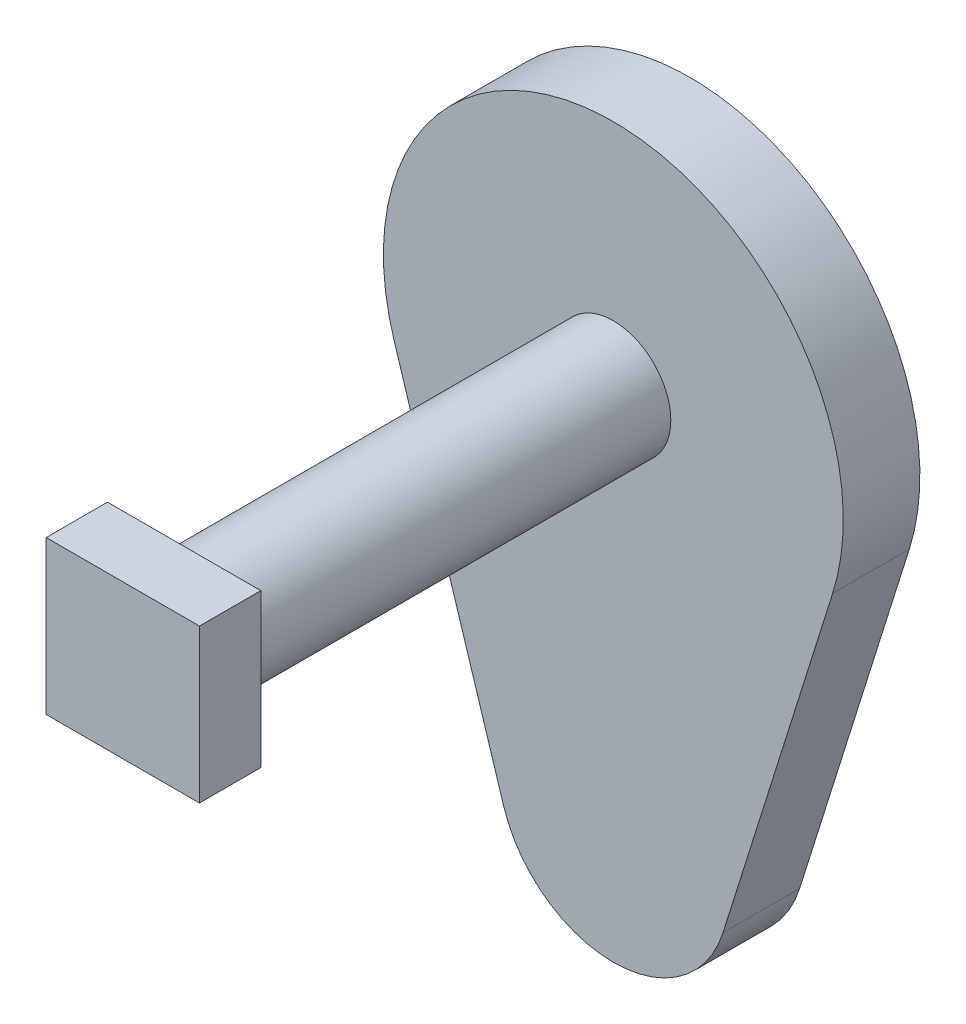
ISO-10303-21;
HEADER;
FILE_DESCRIPTION(('STEP AP214'),'2;1');
FILE_NAME('part.step','',(''),(''),'','','');
FILE_SCHEMA(('AUTOMOTIVE_DESIGN { 1 0 10303 214 1 1 1 1 }'));
ENDSEC;
DATA;
#1=APPLICATION_CONTEXT('core data for automotive mechanical design processes');
#2=APPLICATION_PROTOCOL_DEFINITION('international standard','automotive_design',2000,#1);
#3=PRODUCT_CONTEXT('',#1,'mechanical');
#4=PRODUCT('Part','Part','',(#3));
#5=PRODUCT_RELATED_PRODUCT_CATEGORY('part','',(#4));
#6=PRODUCT_DEFINITION_FORMATION('','',#4);
#7=PRODUCT_DEFINITION_CONTEXT('part definition',#1,'design');
#8=PRODUCT_DEFINITION('design','',#6,#7);
#9=PRODUCT_DEFINITION_SHAPE('','',#8);
#10=(LENGTH_UNIT() NAMED_UNIT(*) SI_UNIT(.MILLI.,.METRE.));
#11=(NAMED_UNIT(*) PLANE_ANGLE_UNIT() SI_UNIT($,.RADIAN.));
#12=(NAMED_UNIT(*) SI_UNIT($,.STERADIAN.) SOLID_ANGLE_UNIT());
#13=UNCERTAINTY_MEASURE_WITH_UNIT(LENGTH_MEASURE(1.E-05),#10,'distance_accuracy_value','');
#14=(GEOMETRIC_REPRESENTATION_CONTEXT(3) GLOBAL_UNCERTAINTY_ASSIGNED_CONTEXT((#13)) GLOBAL_UNIT_ASSIGNED_CONTEXT((#10,
#11,#12)) REPRESENTATION_CONTEXT('',''));
#15=CARTESIAN_POINT('',(0.,0.,0.));
#16=DIRECTION('',(0.,0.,1.));
#17=DIRECTION('',(1.,0.,0.));
#18=AXIS2_PLACEMENT_3D('',#15,#16,#17);
#19=CARTESIAN_POINT('',(-3.66720542821497E-11,50.,10.));
#20=DIRECTION('',(0.,0.,-1.));
#21=DIRECTION('',(-1.,0.,0.));
#22=AXIS2_PLACEMENT_3D('',#19,#20,#21);
#23=CYLINDRICAL_SURFACE('',#22,30.);
#24=CARTESIAN_POINT('',(-3.66720542821497E-11,50.,0.));
#25=DIRECTION('',(0.,0.,1.));
#26=DIRECTION('',(1.,0.,0.));
#27=AXIS2_PLACEMENT_3D('',#24,#25,#26);
#28=CIRCLE('',#27,30.);
#29=CARTESIAN_POINT('',(28.6181760424783,41.000000000021,0.));
#30=VERTEX_POINT('',#29);
#31=CARTESIAN_POINT('',(-28.6181760425384,40.999999999979,0.));
#32=VERTEX_POINT('',#31);
#33=EDGE_CURVE('E143',#30,#32,#28,.T.);
#34=ORIENTED_EDGE('',*,*,#33,.T.);
#35=DIRECTION('',(0.,0.,-1.));
#36=VECTOR('',#35,1.);
#37=CARTESIAN_POINT('',(-28.6181760425384,40.999999999979,10.));
#38=LINE('',#37,#36);
#39=CARTESIAN_POINT('',(-28.6181760425384,40.999999999979,10.));
#40=VERTEX_POINT('',#39);
#41=EDGE_CURVE('E42',#40,#32,#38,.T.);
#42=ORIENTED_EDGE('',*,*,#41,.F.);
#43=CARTESIAN_POINT('',(-3.66720542821497E-11,50.,10.));
#44=DIRECTION('',(0.,0.,1.));
#45=DIRECTION('',(1.,0.,0.));
#46=AXIS2_PLACEMENT_3D('',#43,#44,#45);
#47=CIRCLE('',#46,30.);
#48=CARTESIAN_POINT('',(28.6181760424783,41.000000000021,10.));
#49=VERTEX_POINT('',#48);
#50=EDGE_CURVE('E149',#49,#40,#47,.T.);
#51=ORIENTED_EDGE('',*,*,#50,.F.);
#52=DIRECTION('',(0.,0.,-1.));
#53=VECTOR('',#52,1.);
#54=CARTESIAN_POINT('',(28.6181760424783,41.000000000021,10.));
#55=LINE('',#54,#53);
#56=EDGE_CURVE('E155',#49,#30,#55,.T.);
#57=ORIENTED_EDGE('',*,*,#56,.T.);
#58=EDGE_LOOP('',(#34,#42,#51,#57));
#59=FACE_BOUND('',#58,.T.);
#60=ADVANCED_FACE('F39',(#59),#23,.T.);
#61=CARTESIAN_POINT('',(-28.6181760425384,40.999999999979,10.));
#62=DIRECTION('',(0.953939201416726,0.3000000000007,0.));
#63=DIRECTION('',(-0.3000000000007,0.953939201416726,0.));
#64=AXIS2_PLACEMENT_3D('',#61,#62,#63);
#65=PLANE('',#64);
#66=DIRECTION('',(0.3000000000007,-0.953939201416726,0.));
#67=VECTOR('',#66,1.);
#68=CARTESIAN_POINT('',(-28.6181760425384,40.999999999979,0.));
#69=LINE('',#68,#67);
#70=CARTESIAN_POINT('',(-14.3090880212509,-4.50000000001049,0.));
#71=VERTEX_POINT('',#70);
#72=EDGE_CURVE('E158',#32,#71,#69,.T.);
#73=ORIENTED_EDGE('',*,*,#72,.T.);
#74=DIRECTION('',(0.,0.,-1.));
#75=VECTOR('',#74,1.);
#76=CARTESIAN_POINT('',(-14.3090880212509,-4.50000000001049,10.));
#77=LINE('',#76,#75);
#78=CARTESIAN_POINT('',(-14.3090880212509,-4.50000000001049,10.));
#79=VERTEX_POINT('',#78);
#80=EDGE_CURVE('E164',#79,#71,#77,.T.);
#81=ORIENTED_EDGE('',*,*,#80,.F.);
#82=DIRECTION('',(0.3000000000007,-0.953939201416726,0.));
#83=VECTOR('',#82,1.);
#84=CARTESIAN_POINT('',(-28.6181760425384,40.999999999979,10.));
#85=LINE('',#84,#83);
#86=EDGE_CURVE('E88',#40,#79,#85,.T.);
#87=ORIENTED_EDGE('',*,*,#86,.F.);
#88=ORIENTED_EDGE('',*,*,#41,.T.);
#89=EDGE_LOOP('',(#73,#81,#87,#88));
#90=FACE_BOUND('',#89,.T.);
#91=ADVANCED_FACE('F167',(#90),#65,.F.);
#92=CARTESIAN_POINT('',(0.,0.,10.));
#93=DIRECTION('',(0.,0.,-1.));
#94=DIRECTION('',(-1.,0.,0.));
#95=AXIS2_PLACEMENT_3D('',#92,#93,#94);
#96=CYLINDRICAL_SURFACE('',#95,15.);
#97=CARTESIAN_POINT('',(0.,0.,0.));
#98=DIRECTION('',(0.,0.,1.));
#99=DIRECTION('',(1.,0.,0.));
#100=AXIS2_PLACEMENT_3D('',#97,#98,#99);
#101=CIRCLE('',#100,15.);
#102=CARTESIAN_POINT('',(14.3090880212575,-4.49999999998951,0.));
#103=VERTEX_POINT('',#102);
#104=EDGE_CURVE('E74',#71,#103,#101,.T.);
#105=ORIENTED_EDGE('',*,*,#104,.T.);
#106=DIRECTION('',(0.,0.,-1.));
#107=VECTOR('',#106,1.);
#108=CARTESIAN_POINT('',(14.3090880212575,-4.49999999998951,10.));
#109=LINE('',#108,#107);
#110=CARTESIAN_POINT('',(14.3090880212575,-4.49999999998951,10.));
#111=VERTEX_POINT('',#110);
#112=EDGE_CURVE('E163',#111,#103,#109,.T.);
#113=ORIENTED_EDGE('',*,*,#112,.F.);
#114=CARTESIAN_POINT('',(0.,0.,10.));
#115=DIRECTION('',(0.,0.,1.));
#116=DIRECTION('',(1.,0.,0.));
#117=AXIS2_PLACEMENT_3D('',#114,#115,#116);
#118=CIRCLE('',#117,15.);
#119=EDGE_CURVE('E152',#79,#111,#118,.T.);
#120=ORIENTED_EDGE('',*,*,#119,.F.);
#121=ORIENTED_EDGE('',*,*,#80,.T.);
#122=EDGE_LOOP('',(#105,#113,#120,#121));
#123=FACE_BOUND('',#122,.T.);
#124=ADVANCED_FACE('F192',(#123),#96,.T.);
#125=CARTESIAN_POINT('',(28.6181760424783,41.000000000021,10.));
#126=DIRECTION('',(-0.953939201417166,0.2999999999993,0.));
#127=DIRECTION('',(-0.2999999999993,-0.953939201417166,0.));
#128=AXIS2_PLACEMENT_3D('',#125,#126,#127);
#129=PLANE('',#128);
#130=DIRECTION('',(0.2999999999993,0.953939201417166,0.));
#131=VECTOR('',#130,1.);
#132=CARTESIAN_POINT('',(28.6181760424783,41.000000000021,0.));
#133=LINE('',#132,#131);
#134=EDGE_CURVE('E80',#103,#30,#133,.T.);
#135=ORIENTED_EDGE('',*,*,#134,.T.);
#136=ORIENTED_EDGE('',*,*,#56,.F.);
#137=DIRECTION('',(0.2999999999993,0.953939201417166,0.));
#138=VECTOR('',#137,1.);
#139=CARTESIAN_POINT('',(28.6181760424783,41.000000000021,10.));
#140=LINE('',#139,#138);
#141=EDGE_CURVE('E56',#111,#49,#140,.T.);
#142=ORIENTED_EDGE('',*,*,#141,.F.);
#143=ORIENTED_EDGE('',*,*,#112,.T.);
#144=EDGE_LOOP('',(#135,#136,#142,#143));
#145=FACE_BOUND('',#144,.T.);
#146=ADVANCED_FACE('F184',(#145),#129,.F.);
#147=CARTESIAN_POINT('',(-3.66720542821497E-11,50.,10.));
#148=DIRECTION('',(0.,0.,1.));
#149=DIRECTION('',(1.,0.,0.));
#150=AXIS2_PLACEMENT_3D('',#147,#148,#149);
#151=PLANE('',#150);
#152=CARTESIAN_POINT('',(-3.66720542821497E-11,50.,10.));
#153=DIRECTION('',(0.,0.,1.));
#154=DIRECTION('',(1.,0.,0.));
#155=AXIS2_PLACEMENT_3D('',#152,#153,#154);
#156=CIRCLE('',#155,7.5);
#157=CARTESIAN_POINT('',(7.49999999996333,50.,10.));
#158=VERTEX_POINT('',#157);
#159=EDGE_CURVE('E11',#158,#158,#156,.T.);
#160=ORIENTED_EDGE('',*,*,#159,.F.);
#161=EDGE_LOOP('',(#160));
#162=FACE_BOUND('',#161,.T.);
#163=ORIENTED_EDGE('',*,*,#50,.T.);
#164=ORIENTED_EDGE('',*,*,#86,.T.);
#165=ORIENTED_EDGE('',*,*,#119,.T.);
#166=ORIENTED_EDGE('',*,*,#141,.T.);
#167=EDGE_LOOP('',(#163,#164,#165,#166));
#168=FACE_BOUND('',#167,.T.);
#169=ADVANCED_FACE('F175',(#162,#168),#151,.T.);
#170=CARTESIAN_POINT('',(-3.66720542821497E-11,50.,0.));
#171=DIRECTION('',(0.,0.,1.));
#172=DIRECTION('',(1.,0.,0.));
#173=AXIS2_PLACEMENT_3D('',#170,#171,#172);
#174=PLANE('',#173);
#175=ORIENTED_EDGE('',*,*,#33,.F.);
#176=ORIENTED_EDGE('',*,*,#134,.F.);
#177=ORIENTED_EDGE('',*,*,#104,.F.);
#178=ORIENTED_EDGE('',*,*,#72,.F.);
#179=EDGE_LOOP('',(#175,#176,#177,#178));
#180=FACE_BOUND('',#179,.T.);
#181=ADVANCED_FACE('F172',(#180),#174,.F.);
#182=CARTESIAN_POINT('',(-3.66720542821497E-11,50.,66.));
#183=DIRECTION('',(0.,0.,-1.));
#184=DIRECTION('',(-1.,0.,0.));
#185=AXIS2_PLACEMENT_3D('',#182,#183,#184);
#186=CYLINDRICAL_SURFACE('',#185,7.5);
#187=CARTESIAN_POINT('',(-3.66720542821497E-11,50.,66.));
#188=DIRECTION('',(0.,0.,1.));
#189=DIRECTION('',(1.,0.,0.));
#190=AXIS2_PLACEMENT_3D('',#187,#188,#189);
#191=CIRCLE('',#190,7.5);
#192=CARTESIAN_POINT('',(7.49999999996333,50.,66.));
#193=VERTEX_POINT('',#192);
#194=EDGE_CURVE('E140',#193,#193,#191,.T.);
#195=ORIENTED_EDGE('',*,*,#194,.F.);
#196=EDGE_LOOP('',(#195));
#197=FACE_BOUND('',#196,.T.);
#198=ORIENTED_EDGE('',*,*,#159,.T.);
#199=EDGE_LOOP('',(#198));
#200=FACE_BOUND('',#199,.T.);
#201=ADVANCED_FACE('F174',(#197,#200),#186,.T.);
#202=CARTESIAN_POINT('',(9.99999999996333,40.,74.));
#203=DIRECTION('',(-1.,0.,0.));
#204=DIRECTION('',(0.,0.,1.));
#205=AXIS2_PLACEMENT_3D('',#202,#203,#204);
#206=PLANE('',#205);
#207=DIRECTION('',(0.,1.,0.));
#208=VECTOR('',#207,1.);
#209=CARTESIAN_POINT('',(9.99999999996333,40.,66.));
#210=LINE('',#209,#208);
#211=CARTESIAN_POINT('',(9.99999999996333,40.,66.));
#212=VERTEX_POINT('',#211);
#213=CARTESIAN_POINT('',(9.99999999996333,60.,66.));
#214=VERTEX_POINT('',#213);
#215=EDGE_CURVE('E139',#212,#214,#210,.T.);
#216=ORIENTED_EDGE('',*,*,#215,.T.);
#217=DIRECTION('',(0.,0.,-1.));
#218=VECTOR('',#217,1.);
#219=CARTESIAN_POINT('',(9.99999999996333,60.,74.));
#220=LINE('',#219,#218);
#221=CARTESIAN_POINT('',(9.99999999996333,60.,74.));
#222=VERTEX_POINT('',#221);
#223=EDGE_CURVE('E119',#222,#214,#220,.T.);
#224=ORIENTED_EDGE('',*,*,#223,.F.);
#225=DIRECTION('',(0.,1.,0.));
#226=VECTOR('',#225,1.);
#227=CARTESIAN_POINT('',(9.99999999996333,40.,74.));
#228=LINE('',#227,#226);
#229=CARTESIAN_POINT('',(9.99999999996333,40.,74.));
#230=VERTEX_POINT('',#229);
#231=EDGE_CURVE('E126',#230,#222,#228,.T.);
#232=ORIENTED_EDGE('',*,*,#231,.F.);
#233=DIRECTION('',(0.,0.,-1.));
#234=VECTOR('',#233,1.);
#235=CARTESIAN_POINT('',(9.99999999996333,40.,74.));
#236=LINE('',#235,#234);
#237=EDGE_CURVE('E274',#230,#212,#236,.T.);
#238=ORIENTED_EDGE('',*,*,#237,.T.);
#239=EDGE_LOOP('',(#216,#224,#232,#238));
#240=FACE_BOUND('',#239,.T.);
#241=ADVANCED_FACE('F137',(#240),#206,.F.);
#242=CARTESIAN_POINT('',(-10.0000000000367,60.,74.));
#243=DIRECTION('',(0.,-1.,0.));
#244=DIRECTION('',(0.,0.,-1.));
#245=AXIS2_PLACEMENT_3D('',#242,#243,#244);
#246=PLANE('',#245);
#247=DIRECTION('',(-1.,0.,0.));
#248=VECTOR('',#247,1.);
#249=CARTESIAN_POINT('',(-10.0000000000367,60.,66.));
#250=LINE('',#249,#248);
#251=CARTESIAN_POINT('',(-10.0000000000367,60.,66.));
#252=VERTEX_POINT('',#251);
#253=EDGE_CURVE('E265',#214,#252,#250,.T.);
#254=ORIENTED_EDGE('',*,*,#253,.T.);
#255=DIRECTION('',(0.,0.,-1.));
#256=VECTOR('',#255,1.);
#257=CARTESIAN_POINT('',(-10.0000000000367,60.,74.));
#258=LINE('',#257,#256);
#259=CARTESIAN_POINT('',(-10.0000000000367,60.,74.));
#260=VERTEX_POINT('',#259);
#261=EDGE_CURVE('E122',#260,#252,#258,.T.);
#262=ORIENTED_EDGE('',*,*,#261,.F.);
#263=DIRECTION('',(-1.,0.,0.));
#264=VECTOR('',#263,1.);
#265=CARTESIAN_POINT('',(-10.0000000000367,60.,74.));
#266=LINE('',#265,#264);
#267=EDGE_CURVE('E115',#222,#260,#266,.T.);
#268=ORIENTED_EDGE('',*,*,#267,.F.);
#269=ORIENTED_EDGE('',*,*,#223,.T.);
#270=EDGE_LOOP('',(#254,#262,#268,#269));
#271=FACE_BOUND('',#270,.T.);
#272=ADVANCED_FACE('F117',(#271),#246,.F.);
#273=CARTESIAN_POINT('',(-10.0000000000367,40.,74.));
#274=DIRECTION('',(1.,0.,0.));
#275=DIRECTION('',(0.,0.,-1.));
#276=AXIS2_PLACEMENT_3D('',#273,#274,#275);
#277=PLANE('',#276);
#278=DIRECTION('',(0.,-1.,0.));
#279=VECTOR('',#278,1.);
#280=CARTESIAN_POINT('',(-10.0000000000367,40.,66.));
#281=LINE('',#280,#279);
#282=CARTESIAN_POINT('',(-10.0000000000367,40.,66.));
#283=VERTEX_POINT('',#282);
#284=EDGE_CURVE('E267',#252,#283,#281,.T.);
#285=ORIENTED_EDGE('',*,*,#284,.T.);
#286=DIRECTION('',(0.,0.,-1.));
#287=VECTOR('',#286,1.);
#288=CARTESIAN_POINT('',(-10.0000000000367,40.,74.));
#289=LINE('',#288,#287);
#290=CARTESIAN_POINT('',(-10.0000000000367,40.,74.));
#291=VERTEX_POINT('',#290);
#292=EDGE_CURVE('E145',#291,#283,#289,.T.);
#293=ORIENTED_EDGE('',*,*,#292,.F.);
#294=DIRECTION('',(0.,-1.,0.));
#295=VECTOR('',#294,1.);
#296=CARTESIAN_POINT('',(-10.0000000000367,40.,74.));
#297=LINE('',#296,#295);
#298=EDGE_CURVE('E125',#260,#291,#297,.T.);
#299=ORIENTED_EDGE('',*,*,#298,.F.);
#300=ORIENTED_EDGE('',*,*,#261,.T.);
#301=EDGE_LOOP('',(#285,#293,#299,#300));
#302=FACE_BOUND('',#301,.T.);
#303=ADVANCED_FACE('F230',(#302),#277,.F.);
#304=CARTESIAN_POINT('',(-10.0000000000367,40.,74.));
#305=DIRECTION('',(0.,1.,0.));
#306=DIRECTION('',(0.,0.,1.));
#307=AXIS2_PLACEMENT_3D('',#304,#305,#306);
#308=PLANE('',#307);
#309=DIRECTION('',(1.,0.,0.));
#310=VECTOR('',#309,1.);
#311=CARTESIAN_POINT('',(-10.0000000000367,40.,66.));
#312=LINE('',#311,#310);
#313=EDGE_CURVE('E135',#283,#212,#312,.T.);
#314=ORIENTED_EDGE('',*,*,#313,.T.);
#315=ORIENTED_EDGE('',*,*,#237,.F.);
#316=DIRECTION('',(1.,0.,0.));
#317=VECTOR('',#316,1.);
#318=CARTESIAN_POINT('',(-10.0000000000367,40.,74.));
#319=LINE('',#318,#317);
#320=EDGE_CURVE('E131',#291,#230,#319,.T.);
#321=ORIENTED_EDGE('',*,*,#320,.F.);
#322=ORIENTED_EDGE('',*,*,#292,.T.);
#323=EDGE_LOOP('',(#314,#315,#321,#322));
#324=FACE_BOUND('',#323,.T.);
#325=ADVANCED_FACE('F237',(#324),#308,.F.);
#326=CARTESIAN_POINT('',(0.,0.,74.));
#327=DIRECTION('',(0.,0.,-1.));
#328=DIRECTION('',(-1.,0.,0.));
#329=AXIS2_PLACEMENT_3D('',#326,#327,#328);
#330=PLANE('',#329);
#331=ORIENTED_EDGE('',*,*,#231,.T.);
#332=ORIENTED_EDGE('',*,*,#267,.T.);
#333=ORIENTED_EDGE('',*,*,#298,.T.);
#334=ORIENTED_EDGE('',*,*,#320,.T.);
#335=EDGE_LOOP('',(#331,#332,#333,#334));
#336=FACE_BOUND('',#335,.T.);
#337=ADVANCED_FACE('F129',(#336),#330,.F.);
#338=CARTESIAN_POINT('',(0.,0.,66.));
#339=DIRECTION('',(0.,0.,-1.));
#340=DIRECTION('',(-1.,0.,0.));
#341=AXIS2_PLACEMENT_3D('',#338,#339,#340);
#342=PLANE('',#341);
#343=ORIENTED_EDGE('',*,*,#194,.T.);
#344=EDGE_LOOP('',(#343));
#345=FACE_BOUND('',#344,.T.);
#346=ORIENTED_EDGE('',*,*,#215,.F.);
#347=ORIENTED_EDGE('',*,*,#313,.F.);
#348=ORIENTED_EDGE('',*,*,#284,.F.);
#349=ORIENTED_EDGE('',*,*,#253,.F.);
#350=EDGE_LOOP('',(#346,#347,#348,#349));
#351=FACE_BOUND('',#350,.T.);
#352=ADVANCED_FACE('F252',(#345,#351),#342,.T.);
#353=CLOSED_SHELL('',(#60,#91,#124,#146,#169,#181,#201,#241,#272,#303,#325,#337,#352));
#354=MANIFOLD_SOLID_BREP('B2',#353);
#355=ADVANCED_BREP_SHAPE_REPRESENTATION('',(#18,#354),#14);
#356=SHAPE_DEFINITION_REPRESENTATION(#9,#355);
ENDSEC;
END-ISO-10303-21;
